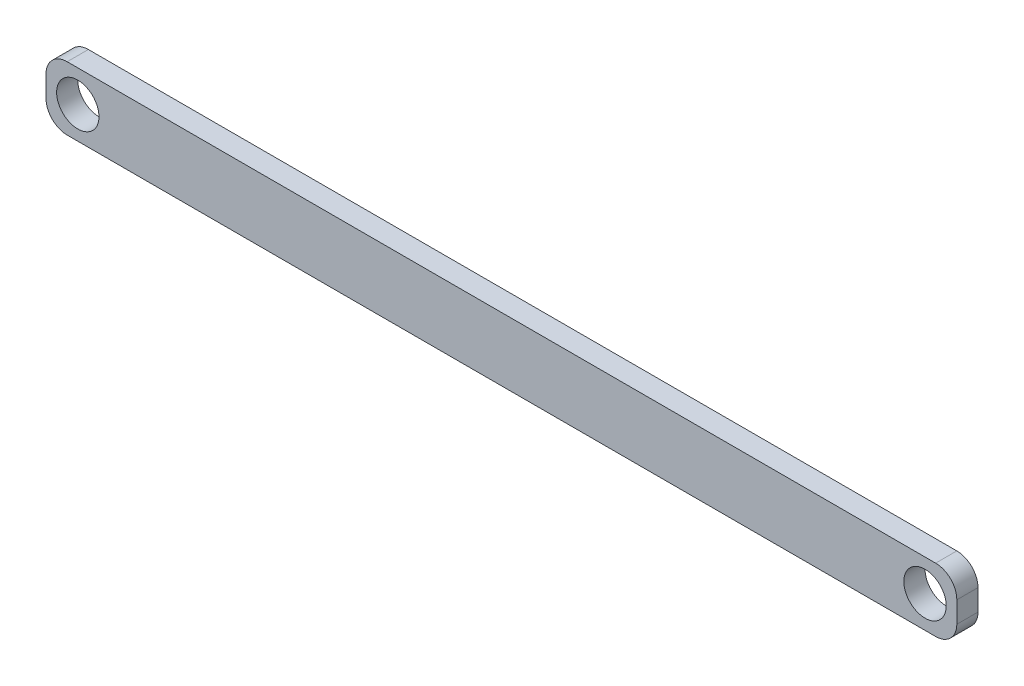
ISO-10303-21;
HEADER;
FILE_DESCRIPTION(('STEP AP214'),'2;1');
FILE_NAME('part.step','',(''),(''),'','','');
FILE_SCHEMA(('AUTOMOTIVE_DESIGN { 1 0 10303 214 1 1 1 1 }'));
ENDSEC;
DATA;
#1=APPLICATION_CONTEXT('core data for automotive mechanical design processes');
#2=APPLICATION_PROTOCOL_DEFINITION('international standard','automotive_design',2000,#1);
#3=PRODUCT_CONTEXT('',#1,'mechanical');
#4=PRODUCT('Part','Part','',(#3));
#5=PRODUCT_RELATED_PRODUCT_CATEGORY('part','',(#4));
#6=PRODUCT_DEFINITION_FORMATION('','',#4);
#7=PRODUCT_DEFINITION_CONTEXT('part definition',#1,'design');
#8=PRODUCT_DEFINITION('design','',#6,#7);
#9=PRODUCT_DEFINITION_SHAPE('','',#8);
#10=(LENGTH_UNIT() NAMED_UNIT(*) SI_UNIT(.MILLI.,.METRE.));
#11=(NAMED_UNIT(*) PLANE_ANGLE_UNIT() SI_UNIT($,.RADIAN.));
#12=(NAMED_UNIT(*) SI_UNIT($,.STERADIAN.) SOLID_ANGLE_UNIT());
#13=UNCERTAINTY_MEASURE_WITH_UNIT(LENGTH_MEASURE(1.E-05),#10,'distance_accuracy_value','');
#14=(GEOMETRIC_REPRESENTATION_CONTEXT(3) GLOBAL_UNCERTAINTY_ASSIGNED_CONTEXT((#13)) GLOBAL_UNIT_ASSIGNED_CONTEXT((#10,
#11,#12)) REPRESENTATION_CONTEXT('',''));
#15=CARTESIAN_POINT('',(0.,0.,0.));
#16=DIRECTION('',(0.,0.,1.));
#17=DIRECTION('',(1.,0.,0.));
#18=AXIS2_PLACEMENT_3D('',#15,#16,#17);
#19=CARTESIAN_POINT('',(205.,5.,5.));
#20=DIRECTION('',(0.,0.,-1.));
#21=DIRECTION('',(-1.,0.,0.));
#22=AXIS2_PLACEMENT_3D('',#19,#20,#21);
#23=PLANE('',#22);
#24=CARTESIAN_POINT('',(-200.,0.,5.));
#25=DIRECTION('',(0.,0.,1.));
#26=DIRECTION('',(1.,0.,0.));
#27=AXIS2_PLACEMENT_3D('',#24,#25,#26);
#28=CIRCLE('',#27,10.);
#29=CARTESIAN_POINT('',(-190.,0.,5.));
#30=VERTEX_POINT('',#29);
#31=EDGE_CURVE('E133',#30,#30,#28,.T.);
#32=ORIENTED_EDGE('',*,*,#31,.F.);
#33=EDGE_LOOP('',(#32));
#34=FACE_BOUND('',#33,.T.);
#35=CARTESIAN_POINT('',(205.,5.,5.));
#36=DIRECTION('',(0.,0.,1.));
#37=DIRECTION('',(-1.,0.,0.));
#38=AXIS2_PLACEMENT_3D('',#35,#36,#37);
#39=CIRCLE('',#38,10.);
#40=CARTESIAN_POINT('',(215.,5.,5.));
#41=VERTEX_POINT('',#40);
#42=CARTESIAN_POINT('',(205.,15.,5.));
#43=VERTEX_POINT('',#42);
#44=EDGE_CURVE('E144',#41,#43,#39,.T.);
#45=ORIENTED_EDGE('',*,*,#44,.T.);
#46=DIRECTION('',(-1.,0.,0.));
#47=VECTOR('',#46,1.);
#48=CARTESIAN_POINT('',(-205.,15.,5.));
#49=LINE('',#48,#47);
#50=CARTESIAN_POINT('',(-205.,15.,5.));
#51=VERTEX_POINT('',#50);
#52=EDGE_CURVE('E92',#43,#51,#49,.T.);
#53=ORIENTED_EDGE('',*,*,#52,.T.);
#54=CARTESIAN_POINT('',(-205.,5.,5.));
#55=DIRECTION('',(0.,0.,1.));
#56=DIRECTION('',(1.,0.,0.));
#57=AXIS2_PLACEMENT_3D('',#54,#55,#56);
#58=CIRCLE('',#57,10.);
#59=CARTESIAN_POINT('',(-215.,5.,5.));
#60=VERTEX_POINT('',#59);
#61=EDGE_CURVE('E159',#51,#60,#58,.T.);
#62=ORIENTED_EDGE('',*,*,#61,.T.);
#63=DIRECTION('',(0.,-1.,0.));
#64=VECTOR('',#63,1.);
#65=CARTESIAN_POINT('',(-215.,5.,5.));
#66=LINE('',#65,#64);
#67=CARTESIAN_POINT('',(-215.,-5.,5.));
#68=VERTEX_POINT('',#67);
#69=EDGE_CURVE('E172',#60,#68,#66,.T.);
#70=ORIENTED_EDGE('',*,*,#69,.T.);
#71=CARTESIAN_POINT('',(-205.,-5.,5.));
#72=DIRECTION('',(0.,0.,1.));
#73=DIRECTION('',(1.,0.,0.));
#74=AXIS2_PLACEMENT_3D('',#71,#72,#73);
#75=CIRCLE('',#74,10.);
#76=CARTESIAN_POINT('',(-205.,-15.,5.));
#77=VERTEX_POINT('',#76);
#78=EDGE_CURVE('E111',#68,#77,#75,.T.);
#79=ORIENTED_EDGE('',*,*,#78,.T.);
#80=DIRECTION('',(1.,0.,0.));
#81=VECTOR('',#80,1.);
#82=CARTESIAN_POINT('',(-205.,-15.,5.));
#83=LINE('',#82,#81);
#84=CARTESIAN_POINT('',(205.,-15.,5.));
#85=VERTEX_POINT('',#84);
#86=EDGE_CURVE('E105',#77,#85,#83,.T.);
#87=ORIENTED_EDGE('',*,*,#86,.T.);
#88=CARTESIAN_POINT('',(205.,-5.,5.));
#89=DIRECTION('',(0.,0.,1.));
#90=DIRECTION('',(1.,0.,0.));
#91=AXIS2_PLACEMENT_3D('',#88,#89,#90);
#92=CIRCLE('',#91,10.);
#93=CARTESIAN_POINT('',(215.,-5.,5.));
#94=VERTEX_POINT('',#93);
#95=EDGE_CURVE('E109',#85,#94,#92,.T.);
#96=ORIENTED_EDGE('',*,*,#95,.T.);
#97=DIRECTION('',(0.,1.,0.));
#98=VECTOR('',#97,1.);
#99=CARTESIAN_POINT('',(215.,5.,5.));
#100=LINE('',#99,#98);
#101=EDGE_CURVE('E49',#94,#41,#100,.T.);
#102=ORIENTED_EDGE('',*,*,#101,.T.);
#103=EDGE_LOOP('',(#45,#53,#62,#70,#79,#87,#96,#102));
#104=FACE_BOUND('',#103,.T.);
#105=CARTESIAN_POINT('',(200.,0.,5.));
#106=DIRECTION('',(0.,0.,1.));
#107=DIRECTION('',(1.,0.,0.));
#108=AXIS2_PLACEMENT_3D('',#105,#106,#107);
#109=CIRCLE('',#108,10.);
#110=CARTESIAN_POINT('',(210.,0.,5.));
#111=VERTEX_POINT('',#110);
#112=EDGE_CURVE('E181',#111,#111,#109,.T.);
#113=ORIENTED_EDGE('',*,*,#112,.F.);
#114=EDGE_LOOP('',(#113));
#115=FACE_BOUND('',#114,.T.);
#116=ADVANCED_FACE('F32',(#34,#104,#115),#23,.F.);
#117=CARTESIAN_POINT('',(205.,5.,-5.));
#118=DIRECTION('',(0.,0.,-1.));
#119=DIRECTION('',(-1.,0.,0.));
#120=AXIS2_PLACEMENT_3D('',#117,#118,#119);
#121=PLANE('',#120);
#122=CARTESIAN_POINT('',(-200.,0.,-5.));
#123=DIRECTION('',(0.,0.,1.));
#124=DIRECTION('',(1.,0.,0.));
#125=AXIS2_PLACEMENT_3D('',#122,#123,#124);
#126=CIRCLE('',#125,10.);
#127=CARTESIAN_POINT('',(-190.,0.,-5.));
#128=VERTEX_POINT('',#127);
#129=EDGE_CURVE('E178',#128,#128,#126,.T.);
#130=ORIENTED_EDGE('',*,*,#129,.T.);
#131=EDGE_LOOP('',(#130));
#132=FACE_BOUND('',#131,.T.);
#133=CARTESIAN_POINT('',(205.,5.,-5.));
#134=DIRECTION('',(0.,0.,1.));
#135=DIRECTION('',(-1.,0.,0.));
#136=AXIS2_PLACEMENT_3D('',#133,#134,#135);
#137=CIRCLE('',#136,10.);
#138=CARTESIAN_POINT('',(215.,5.,-5.));
#139=VERTEX_POINT('',#138);
#140=CARTESIAN_POINT('',(205.,15.,-5.));
#141=VERTEX_POINT('',#140);
#142=EDGE_CURVE('E129',#139,#141,#137,.T.);
#143=ORIENTED_EDGE('',*,*,#142,.F.);
#144=DIRECTION('',(0.,1.,0.));
#145=VECTOR('',#144,1.);
#146=CARTESIAN_POINT('',(215.,5.,-5.));
#147=LINE('',#146,#145);
#148=CARTESIAN_POINT('',(215.,-5.,-5.));
#149=VERTEX_POINT('',#148);
#150=EDGE_CURVE('E84',#149,#139,#147,.T.);
#151=ORIENTED_EDGE('',*,*,#150,.F.);
#152=CARTESIAN_POINT('',(205.,-5.,-5.));
#153=DIRECTION('',(0.,0.,1.));
#154=DIRECTION('',(1.,0.,0.));
#155=AXIS2_PLACEMENT_3D('',#152,#153,#154);
#156=CIRCLE('',#155,10.);
#157=CARTESIAN_POINT('',(205.,-15.,-5.));
#158=VERTEX_POINT('',#157);
#159=EDGE_CURVE('E78',#158,#149,#156,.T.);
#160=ORIENTED_EDGE('',*,*,#159,.F.);
#161=DIRECTION('',(1.,0.,0.));
#162=VECTOR('',#161,1.);
#163=CARTESIAN_POINT('',(-205.,-15.,-5.));
#164=LINE('',#163,#162);
#165=CARTESIAN_POINT('',(-205.,-15.,-5.));
#166=VERTEX_POINT('',#165);
#167=EDGE_CURVE('E119',#166,#158,#164,.T.);
#168=ORIENTED_EDGE('',*,*,#167,.F.);
#169=CARTESIAN_POINT('',(-205.,-5.,-5.));
#170=DIRECTION('',(0.,0.,1.));
#171=DIRECTION('',(1.,0.,0.));
#172=AXIS2_PLACEMENT_3D('',#169,#170,#171);
#173=CIRCLE('',#172,10.);
#174=CARTESIAN_POINT('',(-215.,-5.,-5.));
#175=VERTEX_POINT('',#174);
#176=EDGE_CURVE('E139',#175,#166,#173,.T.);
#177=ORIENTED_EDGE('',*,*,#176,.F.);
#178=DIRECTION('',(0.,-1.,0.));
#179=VECTOR('',#178,1.);
#180=CARTESIAN_POINT('',(-215.,5.,-5.));
#181=LINE('',#180,#179);
#182=CARTESIAN_POINT('',(-215.,5.,-5.));
#183=VERTEX_POINT('',#182);
#184=EDGE_CURVE('E137',#183,#175,#181,.T.);
#185=ORIENTED_EDGE('',*,*,#184,.F.);
#186=CARTESIAN_POINT('',(-205.,5.,-5.));
#187=DIRECTION('',(0.,0.,1.));
#188=DIRECTION('',(1.,0.,0.));
#189=AXIS2_PLACEMENT_3D('',#186,#187,#188);
#190=CIRCLE('',#189,10.);
#191=CARTESIAN_POINT('',(-205.,15.,-5.));
#192=VERTEX_POINT('',#191);
#193=EDGE_CURVE('E135',#192,#183,#190,.T.);
#194=ORIENTED_EDGE('',*,*,#193,.F.);
#195=DIRECTION('',(-1.,0.,0.));
#196=VECTOR('',#195,1.);
#197=CARTESIAN_POINT('',(-205.,15.,-5.));
#198=LINE('',#197,#196);
#199=EDGE_CURVE('E132',#141,#192,#198,.T.);
#200=ORIENTED_EDGE('',*,*,#199,.F.);
#201=EDGE_LOOP('',(#143,#151,#160,#168,#177,#185,#194,#200));
#202=FACE_BOUND('',#201,.T.);
#203=CARTESIAN_POINT('',(200.,0.,-5.));
#204=DIRECTION('',(0.,0.,1.));
#205=DIRECTION('',(1.,0.,0.));
#206=AXIS2_PLACEMENT_3D('',#203,#204,#205);
#207=CIRCLE('',#206,10.);
#208=CARTESIAN_POINT('',(210.,0.,-5.));
#209=VERTEX_POINT('',#208);
#210=EDGE_CURVE('E184',#209,#209,#207,.T.);
#211=ORIENTED_EDGE('',*,*,#210,.T.);
#212=EDGE_LOOP('',(#211));
#213=FACE_BOUND('',#212,.T.);
#214=ADVANCED_FACE('F163',(#132,#202,#213),#121,.T.);
#215=CARTESIAN_POINT('',(205.,5.,5.));
#216=DIRECTION('',(0.,0.,-1.));
#217=DIRECTION('',(-1.,0.,0.));
#218=AXIS2_PLACEMENT_3D('',#215,#216,#217);
#219=CYLINDRICAL_SURFACE('',#218,10.);
#220=ORIENTED_EDGE('',*,*,#142,.T.);
#221=DIRECTION('',(0.,0.,-1.));
#222=VECTOR('',#221,1.);
#223=CARTESIAN_POINT('',(205.,15.,5.));
#224=LINE('',#223,#222);
#225=EDGE_CURVE('E11',#43,#141,#224,.T.);
#226=ORIENTED_EDGE('',*,*,#225,.F.);
#227=ORIENTED_EDGE('',*,*,#44,.F.);
#228=DIRECTION('',(0.,0.,-1.));
#229=VECTOR('',#228,1.);
#230=CARTESIAN_POINT('',(215.,5.,5.));
#231=LINE('',#230,#229);
#232=EDGE_CURVE('E125',#41,#139,#231,.T.);
#233=ORIENTED_EDGE('',*,*,#232,.T.);
#234=EDGE_LOOP('',(#220,#226,#227,#233));
#235=FACE_BOUND('',#234,.T.);
#236=ADVANCED_FACE('F34',(#235),#219,.T.);
#237=CARTESIAN_POINT('',(-205.,15.,5.));
#238=DIRECTION('',(0.,-1.,0.));
#239=DIRECTION('',(0.,0.,-1.));
#240=AXIS2_PLACEMENT_3D('',#237,#238,#239);
#241=PLANE('',#240);
#242=ORIENTED_EDGE('',*,*,#199,.T.);
#243=DIRECTION('',(0.,0.,-1.));
#244=VECTOR('',#243,1.);
#245=CARTESIAN_POINT('',(-205.,15.,5.));
#246=LINE('',#245,#244);
#247=EDGE_CURVE('E41',#51,#192,#246,.T.);
#248=ORIENTED_EDGE('',*,*,#247,.F.);
#249=ORIENTED_EDGE('',*,*,#52,.F.);
#250=ORIENTED_EDGE('',*,*,#225,.T.);
#251=EDGE_LOOP('',(#242,#248,#249,#250));
#252=FACE_BOUND('',#251,.T.);
#253=ADVANCED_FACE('F217',(#252),#241,.F.);
#254=CARTESIAN_POINT('',(-205.,5.,5.));
#255=DIRECTION('',(0.,0.,-1.));
#256=DIRECTION('',(-1.,0.,0.));
#257=AXIS2_PLACEMENT_3D('',#254,#255,#256);
#258=CYLINDRICAL_SURFACE('',#257,10.);
#259=ORIENTED_EDGE('',*,*,#193,.T.);
#260=DIRECTION('',(0.,0.,-1.));
#261=VECTOR('',#260,1.);
#262=CARTESIAN_POINT('',(-215.,5.,5.));
#263=LINE('',#262,#261);
#264=EDGE_CURVE('E151',#60,#183,#263,.T.);
#265=ORIENTED_EDGE('',*,*,#264,.F.);
#266=ORIENTED_EDGE('',*,*,#61,.F.);
#267=ORIENTED_EDGE('',*,*,#247,.T.);
#268=EDGE_LOOP('',(#259,#265,#266,#267));
#269=FACE_BOUND('',#268,.T.);
#270=ADVANCED_FACE('F157',(#269),#258,.T.);
#271=CARTESIAN_POINT('',(-215.,5.,5.));
#272=DIRECTION('',(1.,0.,0.));
#273=DIRECTION('',(0.,0.,-1.));
#274=AXIS2_PLACEMENT_3D('',#271,#272,#273);
#275=PLANE('',#274);
#276=ORIENTED_EDGE('',*,*,#184,.T.);
#277=DIRECTION('',(0.,0.,-1.));
#278=VECTOR('',#277,1.);
#279=CARTESIAN_POINT('',(-215.,-5.,5.));
#280=LINE('',#279,#278);
#281=EDGE_CURVE('E148',#68,#175,#280,.T.);
#282=ORIENTED_EDGE('',*,*,#281,.F.);
#283=ORIENTED_EDGE('',*,*,#69,.F.);
#284=ORIENTED_EDGE('',*,*,#264,.T.);
#285=EDGE_LOOP('',(#276,#282,#283,#284));
#286=FACE_BOUND('',#285,.T.);
#287=ADVANCED_FACE('F168',(#286),#275,.F.);
#288=CARTESIAN_POINT('',(-205.,-5.,5.));
#289=DIRECTION('',(0.,0.,-1.));
#290=DIRECTION('',(-1.,0.,0.));
#291=AXIS2_PLACEMENT_3D('',#288,#289,#290);
#292=CYLINDRICAL_SURFACE('',#291,10.);
#293=ORIENTED_EDGE('',*,*,#176,.T.);
#294=DIRECTION('',(0.,0.,-1.));
#295=VECTOR('',#294,1.);
#296=CARTESIAN_POINT('',(-205.,-15.,5.));
#297=LINE('',#296,#295);
#298=EDGE_CURVE('E120',#77,#166,#297,.T.);
#299=ORIENTED_EDGE('',*,*,#298,.F.);
#300=ORIENTED_EDGE('',*,*,#78,.F.);
#301=ORIENTED_EDGE('',*,*,#281,.T.);
#302=EDGE_LOOP('',(#293,#299,#300,#301));
#303=FACE_BOUND('',#302,.T.);
#304=ADVANCED_FACE('F171',(#303),#292,.T.);
#305=CARTESIAN_POINT('',(-205.,-15.,5.));
#306=DIRECTION('',(0.,1.,0.));
#307=DIRECTION('',(0.,0.,1.));
#308=AXIS2_PLACEMENT_3D('',#305,#306,#307);
#309=PLANE('',#308);
#310=ORIENTED_EDGE('',*,*,#167,.T.);
#311=DIRECTION('',(0.,0.,-1.));
#312=VECTOR('',#311,1.);
#313=CARTESIAN_POINT('',(205.,-15.,5.));
#314=LINE('',#313,#312);
#315=EDGE_CURVE('E116',#85,#158,#314,.T.);
#316=ORIENTED_EDGE('',*,*,#315,.F.);
#317=ORIENTED_EDGE('',*,*,#86,.F.);
#318=ORIENTED_EDGE('',*,*,#298,.T.);
#319=EDGE_LOOP('',(#310,#316,#317,#318));
#320=FACE_BOUND('',#319,.T.);
#321=ADVANCED_FACE('F117',(#320),#309,.F.);
#322=CARTESIAN_POINT('',(205.,-5.,5.));
#323=DIRECTION('',(0.,0.,-1.));
#324=DIRECTION('',(-1.,0.,0.));
#325=AXIS2_PLACEMENT_3D('',#322,#323,#324);
#326=CYLINDRICAL_SURFACE('',#325,10.);
#327=ORIENTED_EDGE('',*,*,#159,.T.);
#328=DIRECTION('',(0.,0.,-1.));
#329=VECTOR('',#328,1.);
#330=CARTESIAN_POINT('',(215.,-5.,5.));
#331=LINE('',#330,#329);
#332=EDGE_CURVE('E121',#94,#149,#331,.T.);
#333=ORIENTED_EDGE('',*,*,#332,.F.);
#334=ORIENTED_EDGE('',*,*,#95,.F.);
#335=ORIENTED_EDGE('',*,*,#315,.T.);
#336=EDGE_LOOP('',(#327,#333,#334,#335));
#337=FACE_BOUND('',#336,.T.);
#338=ADVANCED_FACE('F123',(#337),#326,.T.);
#339=CARTESIAN_POINT('',(215.,5.,5.));
#340=DIRECTION('',(-1.,0.,0.));
#341=DIRECTION('',(0.,0.,1.));
#342=AXIS2_PLACEMENT_3D('',#339,#340,#341);
#343=PLANE('',#342);
#344=ORIENTED_EDGE('',*,*,#150,.T.);
#345=ORIENTED_EDGE('',*,*,#232,.F.);
#346=ORIENTED_EDGE('',*,*,#101,.F.);
#347=ORIENTED_EDGE('',*,*,#332,.T.);
#348=EDGE_LOOP('',(#344,#345,#346,#347));
#349=FACE_BOUND('',#348,.T.);
#350=ADVANCED_FACE('F205',(#349),#343,.F.);
#351=CARTESIAN_POINT('',(-200.,0.,5.));
#352=DIRECTION('',(0.,0.,-1.));
#353=DIRECTION('',(-1.,0.,0.));
#354=AXIS2_PLACEMENT_3D('',#351,#352,#353);
#355=CYLINDRICAL_SURFACE('',#354,10.);
#356=ORIENTED_EDGE('',*,*,#31,.T.);
#357=EDGE_LOOP('',(#356));
#358=FACE_BOUND('',#357,.T.);
#359=ORIENTED_EDGE('',*,*,#129,.F.);
#360=EDGE_LOOP('',(#359));
#361=FACE_BOUND('',#360,.T.);
#362=ADVANCED_FACE('F202',(#358,#361),#355,.F.);
#363=CARTESIAN_POINT('',(200.,0.,5.));
#364=DIRECTION('',(0.,0.,-1.));
#365=DIRECTION('',(-1.,0.,0.));
#366=AXIS2_PLACEMENT_3D('',#363,#364,#365);
#367=CYLINDRICAL_SURFACE('',#366,10.);
#368=ORIENTED_EDGE('',*,*,#112,.T.);
#369=EDGE_LOOP('',(#368));
#370=FACE_BOUND('',#369,.T.);
#371=ORIENTED_EDGE('',*,*,#210,.F.);
#372=EDGE_LOOP('',(#371));
#373=FACE_BOUND('',#372,.T.);
#374=ADVANCED_FACE('F190',(#370,#373),#367,.F.);
#375=CLOSED_SHELL('',(#116,#214,#236,#253,#270,#287,#304,#321,#338,#350,#362,#374));
#376=MANIFOLD_SOLID_BREP('B2',#375);
#377=ADVANCED_BREP_SHAPE_REPRESENTATION('',(#18,#376),#14);
#378=SHAPE_DEFINITION_REPRESENTATION(#9,#377);
ENDSEC;
END-ISO-10303-21;
